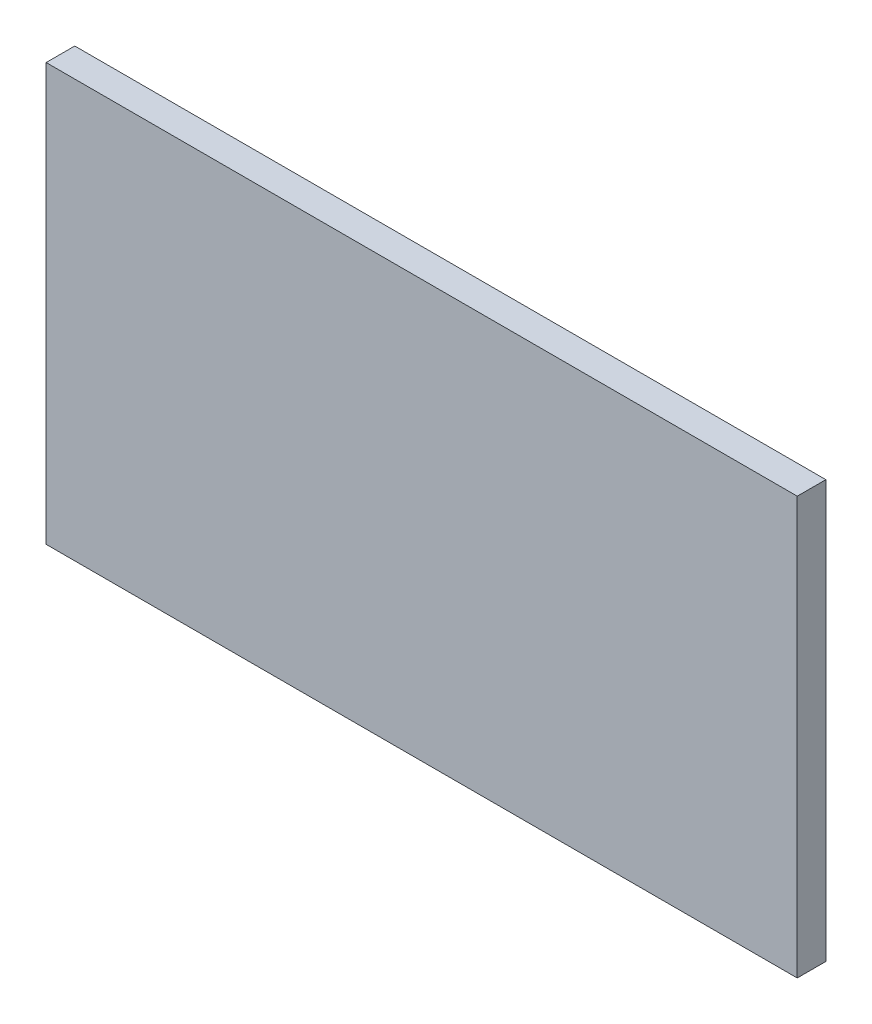
ISO-10303-21;
HEADER;
FILE_DESCRIPTION(('STEP AP214'),'2;1');
FILE_NAME('part.step','',(''),(''),'','','');
FILE_SCHEMA(('AUTOMOTIVE_DESIGN { 1 0 10303 214 1 1 1 1 }'));
ENDSEC;
DATA;
#1=APPLICATION_CONTEXT('core data for automotive mechanical design processes');
#2=APPLICATION_PROTOCOL_DEFINITION('international standard','automotive_design',2000,#1);
#3=PRODUCT_CONTEXT('',#1,'mechanical');
#4=PRODUCT('Part','Part','',(#3));
#5=PRODUCT_RELATED_PRODUCT_CATEGORY('part','',(#4));
#6=PRODUCT_DEFINITION_FORMATION('','',#4);
#7=PRODUCT_DEFINITION_CONTEXT('part definition',#1,'design');
#8=PRODUCT_DEFINITION('design','',#6,#7);
#9=PRODUCT_DEFINITION_SHAPE('','',#8);
#10=(LENGTH_UNIT() NAMED_UNIT(*) SI_UNIT(.MILLI.,.METRE.));
#11=(NAMED_UNIT(*) PLANE_ANGLE_UNIT() SI_UNIT($,.RADIAN.));
#12=(NAMED_UNIT(*) SI_UNIT($,.STERADIAN.) SOLID_ANGLE_UNIT());
#13=UNCERTAINTY_MEASURE_WITH_UNIT(LENGTH_MEASURE(1.E-05),#10,'distance_accuracy_value','');
#14=(GEOMETRIC_REPRESENTATION_CONTEXT(3) GLOBAL_UNCERTAINTY_ASSIGNED_CONTEXT((#13)) GLOBAL_UNIT_ASSIGNED_CONTEXT((#10,
#11,#12)) REPRESENTATION_CONTEXT('',''));
#15=CARTESIAN_POINT('',(0.,0.,0.));
#16=DIRECTION('',(0.,0.,1.));
#17=DIRECTION('',(1.,0.,0.));
#18=AXIS2_PLACEMENT_3D('',#15,#16,#17);
#19=CARTESIAN_POINT('',(12.50008,4.,0.));
#20=DIRECTION('',(0.,0.,-1.));
#21=DIRECTION('',(-1.,0.,0.));
#22=AXIS2_PLACEMENT_3D('',#19,#20,#21);
#23=PLANE('',#22);
#24=DIRECTION('',(1.,0.,0.));
#25=VECTOR('',#24,1.);
#26=CARTESIAN_POINT('',(12.05008,4.25,0.));
#27=LINE('',#26,#25);
#28=CARTESIAN_POINT('',(12.05008,4.25,0.));
#29=VERTEX_POINT('',#28);
#30=CARTESIAN_POINT('',(12.95008,4.25,0.));
#31=VERTEX_POINT('',#30);
#32=EDGE_CURVE('E55',#29,#31,#27,.T.);
#33=ORIENTED_EDGE('',*,*,#32,.T.);
#34=DIRECTION('',(0.,1.,0.));
#35=VECTOR('',#34,1.);
#36=CARTESIAN_POINT('',(12.95008,4.25,0.));
#37=LINE('',#36,#35);
#38=CARTESIAN_POINT('',(12.95008,3.75,0.));
#39=VERTEX_POINT('',#38);
#40=EDGE_CURVE('E57',#31,#39,#37,.F.);
#41=ORIENTED_EDGE('',*,*,#40,.T.);
#42=DIRECTION('',(1.,0.,0.));
#43=VECTOR('',#42,1.);
#44=CARTESIAN_POINT('',(12.95008,3.75,0.));
#45=LINE('',#44,#43);
#46=CARTESIAN_POINT('',(12.05008,3.75,0.));
#47=VERTEX_POINT('',#46);
#48=EDGE_CURVE('E20',#39,#47,#45,.F.);
#49=ORIENTED_EDGE('',*,*,#48,.T.);
#50=DIRECTION('',(0.,1.,0.));
#51=VECTOR('',#50,1.);
#52=CARTESIAN_POINT('',(12.05008,3.75,0.));
#53=LINE('',#52,#51);
#54=EDGE_CURVE('E80',#47,#29,#53,.T.);
#55=ORIENTED_EDGE('',*,*,#54,.T.);
#56=EDGE_LOOP('',(#33,#41,#49,#55));
#57=FACE_BOUND('',#56,.T.);
#58=ADVANCED_FACE('F17',(#57),#23,.T.);
#59=CARTESIAN_POINT('',(12.95008,3.75,0.));
#60=DIRECTION('',(0.,1.,0.));
#61=DIRECTION('',(0.,0.,1.));
#62=AXIS2_PLACEMENT_3D('',#59,#60,#61);
#63=PLANE('',#62);
#64=DIRECTION('',(0.,0.,-1.));
#65=VECTOR('',#64,1.);
#66=CARTESIAN_POINT('',(12.05008,3.75,0.));
#67=LINE('',#66,#65);
#68=CARTESIAN_POINT('',(12.05008,3.75,0.03429));
#69=VERTEX_POINT('',#68);
#70=EDGE_CURVE('E68',#69,#47,#67,.T.);
#71=ORIENTED_EDGE('',*,*,#70,.T.);
#72=ORIENTED_EDGE('',*,*,#48,.F.);
#73=DIRECTION('',(0.,0.,1.));
#74=VECTOR('',#73,1.);
#75=CARTESIAN_POINT('',(12.95008,3.75,0.));
#76=LINE('',#75,#74);
#77=CARTESIAN_POINT('',(12.95008,3.75,0.03429));
#78=VERTEX_POINT('',#77);
#79=EDGE_CURVE('E63',#39,#78,#76,.T.);
#80=ORIENTED_EDGE('',*,*,#79,.T.);
#81=DIRECTION('',(1.,0.,0.));
#82=VECTOR('',#81,1.);
#83=CARTESIAN_POINT('',(12.50008,3.75,0.03429));
#84=LINE('',#83,#82);
#85=EDGE_CURVE('E83',#69,#78,#84,.T.);
#86=ORIENTED_EDGE('',*,*,#85,.F.);
#87=EDGE_LOOP('',(#71,#72,#80,#86));
#88=FACE_BOUND('',#87,.T.);
#89=ADVANCED_FACE('F65',(#88),#63,.F.);
#90=CARTESIAN_POINT('',(12.95008,4.25,0.));
#91=DIRECTION('',(-1.,0.,0.));
#92=DIRECTION('',(0.,0.,1.));
#93=AXIS2_PLACEMENT_3D('',#90,#91,#92);
#94=PLANE('',#93);
#95=ORIENTED_EDGE('',*,*,#79,.F.);
#96=ORIENTED_EDGE('',*,*,#40,.F.);
#97=DIRECTION('',(0.,0.,-1.));
#98=VECTOR('',#97,1.);
#99=CARTESIAN_POINT('',(12.95008,4.25,0.));
#100=LINE('',#99,#98);
#101=CARTESIAN_POINT('',(12.95008,4.25,0.03429));
#102=VERTEX_POINT('',#101);
#103=EDGE_CURVE('E75',#31,#102,#100,.F.);
#104=ORIENTED_EDGE('',*,*,#103,.T.);
#105=DIRECTION('',(0.,1.,0.));
#106=VECTOR('',#105,1.);
#107=CARTESIAN_POINT('',(12.95008,4.,0.03429));
#108=LINE('',#107,#106);
#109=EDGE_CURVE('E72',#78,#102,#108,.T.);
#110=ORIENTED_EDGE('',*,*,#109,.F.);
#111=EDGE_LOOP('',(#95,#96,#104,#110));
#112=FACE_BOUND('',#111,.T.);
#113=ADVANCED_FACE('F70',(#112),#94,.F.);
#114=CARTESIAN_POINT('',(12.05008,4.25,0.));
#115=DIRECTION('',(0.,-1.,0.));
#116=DIRECTION('',(0.,0.,-1.));
#117=AXIS2_PLACEMENT_3D('',#114,#115,#116);
#118=PLANE('',#117);
#119=ORIENTED_EDGE('',*,*,#103,.F.);
#120=ORIENTED_EDGE('',*,*,#32,.F.);
#121=DIRECTION('',(0.,0.,-1.));
#122=VECTOR('',#121,1.);
#123=CARTESIAN_POINT('',(12.05008,4.25,0.));
#124=LINE('',#123,#122);
#125=CARTESIAN_POINT('',(12.05008,4.25,0.03429));
#126=VERTEX_POINT('',#125);
#127=EDGE_CURVE('E35',#29,#126,#124,.F.);
#128=ORIENTED_EDGE('',*,*,#127,.T.);
#129=DIRECTION('',(1.,0.,0.));
#130=VECTOR('',#129,1.);
#131=CARTESIAN_POINT('',(12.50008,4.25,0.03429));
#132=LINE('',#131,#130);
#133=EDGE_CURVE('E26',#102,#126,#132,.F.);
#134=ORIENTED_EDGE('',*,*,#133,.F.);
#135=EDGE_LOOP('',(#119,#120,#128,#134));
#136=FACE_BOUND('',#135,.T.);
#137=ADVANCED_FACE('F89',(#136),#118,.F.);
#138=CARTESIAN_POINT('',(12.05008,3.75,0.));
#139=DIRECTION('',(1.,0.,0.));
#140=DIRECTION('',(0.,0.,-1.));
#141=AXIS2_PLACEMENT_3D('',#138,#139,#140);
#142=PLANE('',#141);
#143=ORIENTED_EDGE('',*,*,#127,.F.);
#144=ORIENTED_EDGE('',*,*,#54,.F.);
#145=ORIENTED_EDGE('',*,*,#70,.F.);
#146=DIRECTION('',(0.,1.,0.));
#147=VECTOR('',#146,1.);
#148=CARTESIAN_POINT('',(12.05008,4.,0.03429));
#149=LINE('',#148,#147);
#150=EDGE_CURVE('E11',#126,#69,#149,.F.);
#151=ORIENTED_EDGE('',*,*,#150,.F.);
#152=EDGE_LOOP('',(#143,#144,#145,#151));
#153=FACE_BOUND('',#152,.T.);
#154=ADVANCED_FACE('F91',(#153),#142,.F.);
#155=CARTESIAN_POINT('',(12.50008,4.,0.03429));
#156=DIRECTION('',(0.,0.,1.));
#157=DIRECTION('',(1.,0.,0.));
#158=AXIS2_PLACEMENT_3D('',#155,#156,#157);
#159=PLANE('',#158);
#160=ORIENTED_EDGE('',*,*,#133,.T.);
#161=ORIENTED_EDGE('',*,*,#150,.T.);
#162=ORIENTED_EDGE('',*,*,#85,.T.);
#163=ORIENTED_EDGE('',*,*,#109,.T.);
#164=EDGE_LOOP('',(#160,#161,#162,#163));
#165=FACE_BOUND('',#164,.T.);
#166=ADVANCED_FACE('F88',(#165),#159,.T.);
#167=CLOSED_SHELL('',(#58,#89,#113,#137,#154,#166));
#168=MANIFOLD_SOLID_BREP('B1',#167);
#169=ADVANCED_BREP_SHAPE_REPRESENTATION('',(#18,#168),#14);
#170=SHAPE_DEFINITION_REPRESENTATION(#9,#169);
ENDSEC;
END-ISO-10303-21;
